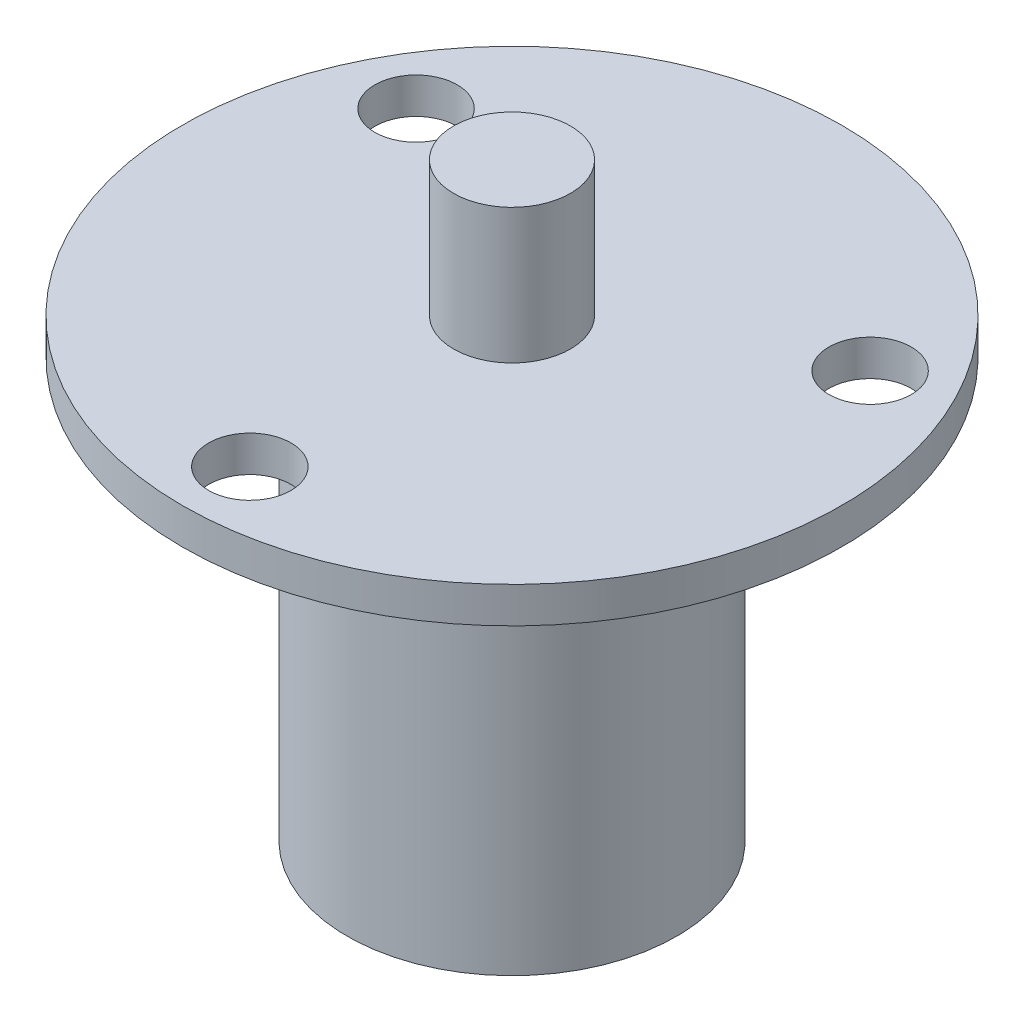
ISO-10303-21;
HEADER;
FILE_DESCRIPTION(('STEP AP214'),'2;1');
FILE_NAME('part.step','',(''),(''),'','','');
FILE_SCHEMA(('AUTOMOTIVE_DESIGN { 1 0 10303 214 1 1 1 1 }'));
ENDSEC;
DATA;
#1=APPLICATION_CONTEXT('core data for automotive mechanical design processes');
#2=APPLICATION_PROTOCOL_DEFINITION('international standard','automotive_design',2000,#1);
#3=PRODUCT_CONTEXT('',#1,'mechanical');
#4=PRODUCT('Part','Part','',(#3));
#5=PRODUCT_RELATED_PRODUCT_CATEGORY('part','',(#4));
#6=PRODUCT_DEFINITION_FORMATION('','',#4);
#7=PRODUCT_DEFINITION_CONTEXT('part definition',#1,'design');
#8=PRODUCT_DEFINITION('design','',#6,#7);
#9=PRODUCT_DEFINITION_SHAPE('','',#8);
#10=(LENGTH_UNIT() NAMED_UNIT(*) SI_UNIT(.MILLI.,.METRE.));
#11=(NAMED_UNIT(*) PLANE_ANGLE_UNIT() SI_UNIT($,.RADIAN.));
#12=(NAMED_UNIT(*) SI_UNIT($,.STERADIAN.) SOLID_ANGLE_UNIT());
#13=UNCERTAINTY_MEASURE_WITH_UNIT(LENGTH_MEASURE(1.E-05),#10,'distance_accuracy_value','');
#14=(GEOMETRIC_REPRESENTATION_CONTEXT(3) GLOBAL_UNCERTAINTY_ASSIGNED_CONTEXT((#13)) GLOBAL_UNIT_ASSIGNED_CONTEXT((#10,
#11,#12)) REPRESENTATION_CONTEXT('',''));
#15=CARTESIAN_POINT('',(0.,0.,0.));
#16=DIRECTION('',(0.,0.,1.));
#17=DIRECTION('',(1.,0.,0.));
#18=AXIS2_PLACEMENT_3D('',#15,#16,#17);
#19=CARTESIAN_POINT('',(0.,2.4,0.));
#20=DIRECTION('',(0.,1.,0.));
#21=DIRECTION('',(0.,0.,1.));
#22=AXIS2_PLACEMENT_3D('',#19,#20,#21);
#23=PLANE('',#22);
#24=CARTESIAN_POINT('',(0.,2.4,0.));
#25=DIRECTION('',(0.,1.,0.));
#26=DIRECTION('',(0.,0.,1.));
#27=AXIS2_PLACEMENT_3D('',#24,#25,#26);
#28=CIRCLE('',#27,3.9);
#29=CARTESIAN_POINT('',(0.,2.4,3.9));
#30=VERTEX_POINT('',#29);
#31=EDGE_CURVE('E52',#30,#30,#28,.T.);
#32=ORIENTED_EDGE('',*,*,#31,.F.);
#33=EDGE_LOOP('',(#32));
#34=FACE_BOUND('',#33,.T.);
#35=CARTESIAN_POINT('',(-15.1554445662276,2.4,-8.75000000000007));
#36=DIRECTION('',(0.,1.,0.));
#37=DIRECTION('',(0.,0.,1.));
#38=AXIS2_PLACEMENT_3D('',#35,#36,#37);
#39=CIRCLE('',#38,2.75);
#40=CARTESIAN_POINT('',(-15.1554445662276,2.4,-6.00000000000007));
#41=VERTEX_POINT('',#40);
#42=EDGE_CURVE('E61',#41,#41,#39,.T.);
#43=ORIENTED_EDGE('',*,*,#42,.F.);
#44=EDGE_LOOP('',(#43));
#45=FACE_BOUND('',#44,.T.);
#46=CARTESIAN_POINT('',(0.,2.4,0.));
#47=DIRECTION('',(0.,1.,0.));
#48=DIRECTION('',(0.,0.,1.));
#49=AXIS2_PLACEMENT_3D('',#46,#47,#48);
#50=CIRCLE('',#49,22.);
#51=CARTESIAN_POINT('',(0.,2.4,22.));
#52=VERTEX_POINT('',#51);
#53=EDGE_CURVE('E40',#52,#52,#50,.T.);
#54=ORIENTED_EDGE('',*,*,#53,.T.);
#55=EDGE_LOOP('',(#54));
#56=FACE_BOUND('',#55,.T.);
#57=CARTESIAN_POINT('',(15.1554445662276,2.4,-8.75000000000008));
#58=DIRECTION('',(0.,1.,0.));
#59=DIRECTION('',(0.,0.,1.));
#60=AXIS2_PLACEMENT_3D('',#57,#58,#59);
#61=CIRCLE('',#60,2.75);
#62=CARTESIAN_POINT('',(15.1554445662276,2.4,-6.00000000000008));
#63=VERTEX_POINT('',#62);
#64=EDGE_CURVE('E67',#63,#63,#61,.T.);
#65=ORIENTED_EDGE('',*,*,#64,.F.);
#66=EDGE_LOOP('',(#65));
#67=FACE_BOUND('',#66,.T.);
#68=CARTESIAN_POINT('',(0.,2.4,17.5));
#69=DIRECTION('',(0.,1.,0.));
#70=DIRECTION('',(0.,0.,1.));
#71=AXIS2_PLACEMENT_3D('',#68,#69,#70);
#72=CIRCLE('',#71,2.75);
#73=CARTESIAN_POINT('',(0.,2.4,20.25));
#74=VERTEX_POINT('',#73);
#75=EDGE_CURVE('E55',#74,#74,#72,.T.);
#76=ORIENTED_EDGE('',*,*,#75,.F.);
#77=EDGE_LOOP('',(#76));
#78=FACE_BOUND('',#77,.T.);
#79=ADVANCED_FACE('F32',(#34,#45,#56,#67,#78),#23,.T.);
#80=CARTESIAN_POINT('',(0.,0.,0.));
#81=DIRECTION('',(0.,1.,0.));
#82=DIRECTION('',(0.,0.,1.));
#83=AXIS2_PLACEMENT_3D('',#80,#81,#82);
#84=PLANE('',#83);
#85=CARTESIAN_POINT('',(0.,0.,0.));
#86=DIRECTION('',(0.,-1.,0.));
#87=DIRECTION('',(0.,0.,-1.));
#88=AXIS2_PLACEMENT_3D('',#85,#86,#87);
#89=CIRCLE('',#88,11.);
#90=CARTESIAN_POINT('',(0.,0.,-11.));
#91=VERTEX_POINT('',#90);
#92=EDGE_CURVE('E10',#91,#91,#89,.T.);
#93=ORIENTED_EDGE('',*,*,#92,.F.);
#94=EDGE_LOOP('',(#93));
#95=FACE_BOUND('',#94,.T.);
#96=CARTESIAN_POINT('',(0.,0.,0.));
#97=DIRECTION('',(0.,1.,0.));
#98=DIRECTION('',(0.,0.,1.));
#99=AXIS2_PLACEMENT_3D('',#96,#97,#98);
#100=CIRCLE('',#99,22.);
#101=CARTESIAN_POINT('',(0.,0.,22.));
#102=VERTEX_POINT('',#101);
#103=EDGE_CURVE('E36',#102,#102,#100,.T.);
#104=ORIENTED_EDGE('',*,*,#103,.F.);
#105=EDGE_LOOP('',(#104));
#106=FACE_BOUND('',#105,.T.);
#107=CARTESIAN_POINT('',(15.1554445662276,0.,-8.75000000000008));
#108=DIRECTION('',(0.,1.,0.));
#109=DIRECTION('',(0.,0.,1.));
#110=AXIS2_PLACEMENT_3D('',#107,#108,#109);
#111=CIRCLE('',#110,2.75);
#112=CARTESIAN_POINT('',(15.1554445662276,0.,-6.00000000000008));
#113=VERTEX_POINT('',#112);
#114=EDGE_CURVE('E64',#113,#113,#111,.T.);
#115=ORIENTED_EDGE('',*,*,#114,.T.);
#116=EDGE_LOOP('',(#115));
#117=FACE_BOUND('',#116,.T.);
#118=CARTESIAN_POINT('',(-15.1554445662276,0.,-8.75000000000007));
#119=DIRECTION('',(0.,1.,0.));
#120=DIRECTION('',(0.,0.,1.));
#121=AXIS2_PLACEMENT_3D('',#118,#119,#120);
#122=CIRCLE('',#121,2.75);
#123=CARTESIAN_POINT('',(-15.1554445662276,0.,-6.00000000000007));
#124=VERTEX_POINT('',#123);
#125=EDGE_CURVE('E58',#124,#124,#122,.T.);
#126=ORIENTED_EDGE('',*,*,#125,.T.);
#127=EDGE_LOOP('',(#126));
#128=FACE_BOUND('',#127,.T.);
#129=CARTESIAN_POINT('',(0.,0.,17.5));
#130=DIRECTION('',(0.,1.,0.));
#131=DIRECTION('',(0.,0.,1.));
#132=AXIS2_PLACEMENT_3D('',#129,#130,#131);
#133=CIRCLE('',#132,2.75);
#134=CARTESIAN_POINT('',(0.,0.,20.25));
#135=VERTEX_POINT('',#134);
#136=EDGE_CURVE('E51',#135,#135,#133,.T.);
#137=ORIENTED_EDGE('',*,*,#136,.T.);
#138=EDGE_LOOP('',(#137));
#139=FACE_BOUND('',#138,.T.);
#140=ADVANCED_FACE('F73',(#95,#106,#117,#128,#139),#84,.F.);
#141=CARTESIAN_POINT('',(0.,2.4,0.));
#142=DIRECTION('',(0.,-1.,0.));
#143=DIRECTION('',(0.,0.,-1.));
#144=AXIS2_PLACEMENT_3D('',#141,#142,#143);
#145=CYLINDRICAL_SURFACE('',#144,22.);
#146=ORIENTED_EDGE('',*,*,#53,.F.);
#147=EDGE_LOOP('',(#146));
#148=FACE_BOUND('',#147,.T.);
#149=ORIENTED_EDGE('',*,*,#103,.T.);
#150=EDGE_LOOP('',(#149));
#151=FACE_BOUND('',#150,.T.);
#152=ADVANCED_FACE('F34',(#148,#151),#145,.T.);
#153=CARTESIAN_POINT('',(15.1554445662276,2.4,-8.75000000000008));
#154=DIRECTION('',(0.,-1.,0.));
#155=DIRECTION('',(0.,0.,-1.));
#156=AXIS2_PLACEMENT_3D('',#153,#154,#155);
#157=CYLINDRICAL_SURFACE('',#156,2.75);
#158=ORIENTED_EDGE('',*,*,#64,.T.);
#159=EDGE_LOOP('',(#158));
#160=FACE_BOUND('',#159,.T.);
#161=ORIENTED_EDGE('',*,*,#114,.F.);
#162=EDGE_LOOP('',(#161));
#163=FACE_BOUND('',#162,.T.);
#164=ADVANCED_FACE('F76',(#160,#163),#157,.F.);
#165=CARTESIAN_POINT('',(-15.1554445662276,2.4,-8.75000000000007));
#166=DIRECTION('',(0.,-1.,0.));
#167=DIRECTION('',(0.,0.,-1.));
#168=AXIS2_PLACEMENT_3D('',#165,#166,#167);
#169=CYLINDRICAL_SURFACE('',#168,2.75);
#170=ORIENTED_EDGE('',*,*,#42,.T.);
#171=EDGE_LOOP('',(#170));
#172=FACE_BOUND('',#171,.T.);
#173=ORIENTED_EDGE('',*,*,#125,.F.);
#174=EDGE_LOOP('',(#173));
#175=FACE_BOUND('',#174,.T.);
#176=ADVANCED_FACE('F78',(#172,#175),#169,.F.);
#177=CARTESIAN_POINT('',(0.,2.4,17.5));
#178=DIRECTION('',(0.,-1.,0.));
#179=DIRECTION('',(0.,0.,-1.));
#180=AXIS2_PLACEMENT_3D('',#177,#178,#179);
#181=CYLINDRICAL_SURFACE('',#180,2.75);
#182=ORIENTED_EDGE('',*,*,#75,.T.);
#183=EDGE_LOOP('',(#182));
#184=FACE_BOUND('',#183,.T.);
#185=ORIENTED_EDGE('',*,*,#136,.F.);
#186=EDGE_LOOP('',(#185));
#187=FACE_BOUND('',#186,.T.);
#188=ADVANCED_FACE('F85',(#184,#187),#181,.F.);
#189=CARTESIAN_POINT('',(0.,11.4,0.));
#190=DIRECTION('',(0.,-1.,0.));
#191=DIRECTION('',(0.,0.,-1.));
#192=AXIS2_PLACEMENT_3D('',#189,#190,#191);
#193=CYLINDRICAL_SURFACE('',#192,3.9);
#194=CARTESIAN_POINT('',(0.,11.4,0.));
#195=DIRECTION('',(0.,1.,0.));
#196=DIRECTION('',(0.,0.,1.));
#197=AXIS2_PLACEMENT_3D('',#194,#195,#196);
#198=CIRCLE('',#197,3.9);
#199=CARTESIAN_POINT('',(0.,11.4,3.9));
#200=VERTEX_POINT('',#199);
#201=EDGE_CURVE('E48',#200,#200,#198,.T.);
#202=ORIENTED_EDGE('',*,*,#201,.F.);
#203=EDGE_LOOP('',(#202));
#204=FACE_BOUND('',#203,.T.);
#205=ORIENTED_EDGE('',*,*,#31,.T.);
#206=EDGE_LOOP('',(#205));
#207=FACE_BOUND('',#206,.T.);
#208=ADVANCED_FACE('F108',(#204,#207),#193,.T.);
#209=CARTESIAN_POINT('',(0.,11.4,0.));
#210=DIRECTION('',(0.,1.,0.));
#211=DIRECTION('',(0.,0.,1.));
#212=AXIS2_PLACEMENT_3D('',#209,#210,#211);
#213=PLANE('',#212);
#214=ORIENTED_EDGE('',*,*,#201,.T.);
#215=EDGE_LOOP('',(#214));
#216=FACE_BOUND('',#215,.T.);
#217=ADVANCED_FACE('F115',(#216),#213,.T.);
#218=CARTESIAN_POINT('',(0.,-28.,0.));
#219=DIRECTION('',(0.,1.,0.));
#220=DIRECTION('',(0.,0.,1.));
#221=AXIS2_PLACEMENT_3D('',#218,#219,#220);
#222=CYLINDRICAL_SURFACE('',#221,11.);
#223=CARTESIAN_POINT('',(0.,-28.,0.));
#224=DIRECTION('',(0.,-1.,0.));
#225=DIRECTION('',(0.,0.,-1.));
#226=AXIS2_PLACEMENT_3D('',#223,#224,#225);
#227=CIRCLE('',#226,11.);
#228=CARTESIAN_POINT('',(0.,-28.,-11.));
#229=VERTEX_POINT('',#228);
#230=EDGE_CURVE('E47',#229,#229,#227,.T.);
#231=ORIENTED_EDGE('',*,*,#230,.F.);
#232=EDGE_LOOP('',(#231));
#233=FACE_BOUND('',#232,.T.);
#234=ORIENTED_EDGE('',*,*,#92,.T.);
#235=EDGE_LOOP('',(#234));
#236=FACE_BOUND('',#235,.T.);
#237=ADVANCED_FACE('F121',(#233,#236),#222,.T.);
#238=CARTESIAN_POINT('',(0.,-28.,0.));
#239=DIRECTION('',(0.,-1.,0.));
#240=DIRECTION('',(0.,0.,-1.));
#241=AXIS2_PLACEMENT_3D('',#238,#239,#240);
#242=PLANE('',#241);
#243=ORIENTED_EDGE('',*,*,#230,.T.);
#244=EDGE_LOOP('',(#243));
#245=FACE_BOUND('',#244,.T.);
#246=ADVANCED_FACE('F125',(#245),#242,.T.);
#247=CLOSED_SHELL('',(#79,#140,#152,#164,#176,#188,#208,#217,#237,#246));
#248=MANIFOLD_SOLID_BREP('B2',#247);
#249=ADVANCED_BREP_SHAPE_REPRESENTATION('',(#18,#248),#14);
#250=SHAPE_DEFINITION_REPRESENTATION(#9,#249);
ENDSEC;
END-ISO-10303-21;
